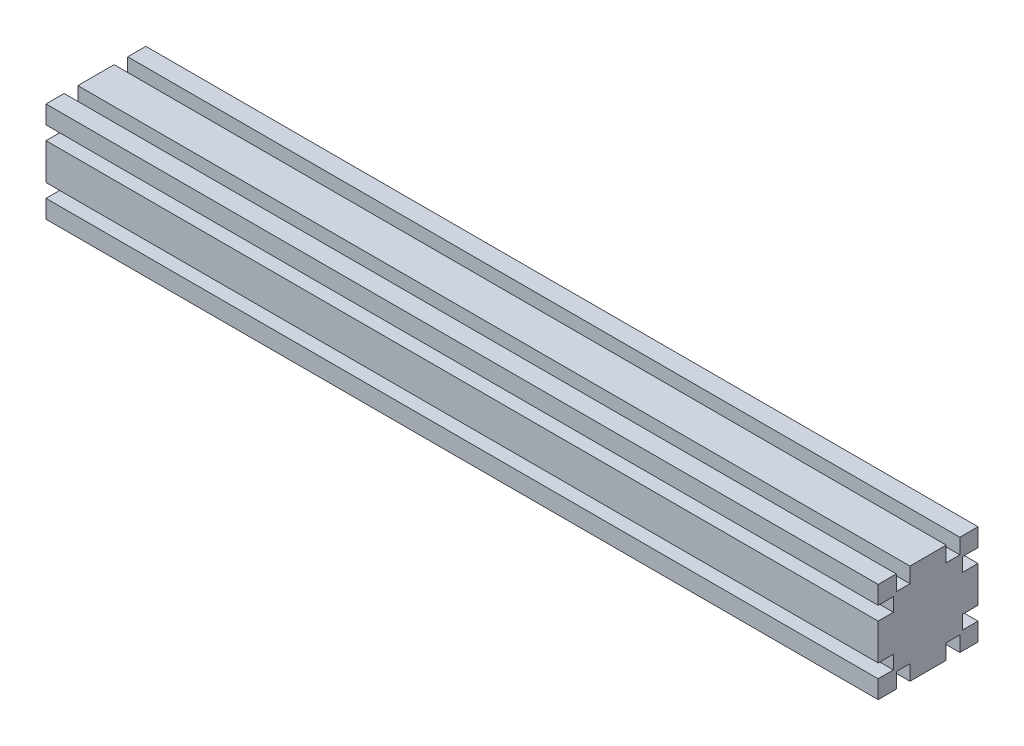
ISO-10303-21;
HEADER;
FILE_DESCRIPTION(('STEP AP214'),'2;1');
FILE_NAME('part.step','',(''),(''),'','','');
FILE_SCHEMA(('AUTOMOTIVE_DESIGN { 1 0 10303 214 1 1 1 1 }'));
ENDSEC;
DATA;
#1=APPLICATION_CONTEXT('core data for automotive mechanical design processes');
#2=APPLICATION_PROTOCOL_DEFINITION('international standard','automotive_design',2000,#1);
#3=PRODUCT_CONTEXT('',#1,'mechanical');
#4=PRODUCT('Part','Part','',(#3));
#5=PRODUCT_RELATED_PRODUCT_CATEGORY('part','',(#4));
#6=PRODUCT_DEFINITION_FORMATION('','',#4);
#7=PRODUCT_DEFINITION_CONTEXT('part definition',#1,'design');
#8=PRODUCT_DEFINITION('design','',#6,#7);
#9=PRODUCT_DEFINITION_SHAPE('','',#8);
#10=(LENGTH_UNIT() NAMED_UNIT(*) SI_UNIT(.MILLI.,.METRE.));
#11=(NAMED_UNIT(*) PLANE_ANGLE_UNIT() SI_UNIT($,.RADIAN.));
#12=(NAMED_UNIT(*) SI_UNIT($,.STERADIAN.) SOLID_ANGLE_UNIT());
#13=UNCERTAINTY_MEASURE_WITH_UNIT(LENGTH_MEASURE(1.E-05),#10,'distance_accuracy_value','');
#14=(GEOMETRIC_REPRESENTATION_CONTEXT(3) GLOBAL_UNCERTAINTY_ASSIGNED_CONTEXT((#13)) GLOBAL_UNIT_ASSIGNED_CONTEXT((#10,
#11,#12)) REPRESENTATION_CONTEXT('',''));
#15=CARTESIAN_POINT('',(0.,0.,0.));
#16=DIRECTION('',(0.,0.,1.));
#17=DIRECTION('',(1.,0.,0.));
#18=AXIS2_PLACEMENT_3D('',#15,#16,#17);
#19=CARTESIAN_POINT('',(500.,30.,-30.));
#20=DIRECTION('',(0.,0.,1.));
#21=DIRECTION('',(0.,-1.,0.));
#22=AXIS2_PLACEMENT_3D('',#19,#20,#21);
#23=PLANE('',#22);
#24=DIRECTION('',(0.,1.,0.));
#25=VECTOR('',#24,1.);
#26=CARTESIAN_POINT('',(500.,30.,-30.));
#27=LINE('',#26,#25);
#28=CARTESIAN_POINT('',(500.,19.1,-30.));
#29=VERTEX_POINT('',#28);
#30=CARTESIAN_POINT('',(500.,30.,-30.));
#31=VERTEX_POINT('',#30);
#32=EDGE_CURVE('E299',#29,#31,#27,.T.);
#33=ORIENTED_EDGE('',*,*,#32,.F.);
#34=DIRECTION('',(-1.,0.,0.));
#35=VECTOR('',#34,1.);
#36=CARTESIAN_POINT('',(500.,19.1,-30.));
#37=LINE('',#36,#35);
#38=CARTESIAN_POINT('',(0.,19.1,-30.));
#39=VERTEX_POINT('',#38);
#40=EDGE_CURVE('E451',#29,#39,#37,.T.);
#41=ORIENTED_EDGE('',*,*,#40,.T.);
#42=DIRECTION('',(0.,1.,0.));
#43=VECTOR('',#42,1.);
#44=CARTESIAN_POINT('',(0.,30.,-30.));
#45=LINE('',#44,#43);
#46=CARTESIAN_POINT('',(0.,30.,-30.));
#47=VERTEX_POINT('',#46);
#48=EDGE_CURVE('E328',#39,#47,#45,.T.);
#49=ORIENTED_EDGE('',*,*,#48,.T.);
#50=DIRECTION('',(-1.,0.,0.));
#51=VECTOR('',#50,1.);
#52=CARTESIAN_POINT('',(500.,30.,-30.));
#53=LINE('',#52,#51);
#54=EDGE_CURVE('E11',#31,#47,#53,.T.);
#55=ORIENTED_EDGE('',*,*,#54,.F.);
#56=EDGE_LOOP('',(#33,#41,#49,#55));
#57=FACE_BOUND('',#56,.T.);
#58=ADVANCED_FACE('F36',(#57),#23,.F.);
#59=CARTESIAN_POINT('',(0.,-10.9,-30.));
#60=VERTEX_POINT('',#59);
#61=CARTESIAN_POINT('',(0.,10.9,-30.));
#62=VERTEX_POINT('',#61);
#63=EDGE_CURVE('E327',#60,#62,#45,.T.);
#64=ORIENTED_EDGE('',*,*,#63,.T.);
#65=DIRECTION('',(-1.,0.,0.));
#66=VECTOR('',#65,1.);
#67=CARTESIAN_POINT('',(500.,10.9,-30.));
#68=LINE('',#67,#66);
#69=CARTESIAN_POINT('',(500.,10.9,-30.));
#70=VERTEX_POINT('',#69);
#71=EDGE_CURVE('E297',#70,#62,#68,.T.);
#72=ORIENTED_EDGE('',*,*,#71,.F.);
#73=CARTESIAN_POINT('',(500.,-10.9,-30.));
#74=VERTEX_POINT('',#73);
#75=EDGE_CURVE('E289',#74,#70,#27,.T.);
#76=ORIENTED_EDGE('',*,*,#75,.F.);
#77=DIRECTION('',(-1.,0.,0.));
#78=VECTOR('',#77,1.);
#79=CARTESIAN_POINT('',(500.,-10.9,-30.));
#80=LINE('',#79,#78);
#81=EDGE_CURVE('E270',#74,#60,#80,.T.);
#82=ORIENTED_EDGE('',*,*,#81,.T.);
#83=EDGE_LOOP('',(#64,#72,#76,#82));
#84=FACE_BOUND('',#83,.T.);
#85=ADVANCED_FACE('F296',(#84),#23,.F.);
#86=CARTESIAN_POINT('',(500.,30.,30.));
#87=DIRECTION('',(0.,-1.,0.));
#88=DIRECTION('',(0.,0.,-1.));
#89=AXIS2_PLACEMENT_3D('',#86,#87,#88);
#90=PLANE('',#89);
#91=DIRECTION('',(0.,0.,1.));
#92=VECTOR('',#91,1.);
#93=CARTESIAN_POINT('',(500.,30.,30.));
#94=LINE('',#93,#92);
#95=CARTESIAN_POINT('',(500.,30.,19.1));
#96=VERTEX_POINT('',#95);
#97=CARTESIAN_POINT('',(500.,30.,30.));
#98=VERTEX_POINT('',#97);
#99=EDGE_CURVE('E302',#96,#98,#94,.T.);
#100=ORIENTED_EDGE('',*,*,#99,.F.);
#101=DIRECTION('',(-1.,0.,0.));
#102=VECTOR('',#101,1.);
#103=CARTESIAN_POINT('',(500.,30.,19.1));
#104=LINE('',#103,#102);
#105=CARTESIAN_POINT('',(0.,30.,19.1));
#106=VERTEX_POINT('',#105);
#107=EDGE_CURVE('E447',#96,#106,#104,.T.);
#108=ORIENTED_EDGE('',*,*,#107,.T.);
#109=DIRECTION('',(0.,0.,1.));
#110=VECTOR('',#109,1.);
#111=CARTESIAN_POINT('',(0.,30.,30.));
#112=LINE('',#111,#110);
#113=CARTESIAN_POINT('',(0.,30.,30.));
#114=VERTEX_POINT('',#113);
#115=EDGE_CURVE('E326',#106,#114,#112,.T.);
#116=ORIENTED_EDGE('',*,*,#115,.T.);
#117=DIRECTION('',(-1.,0.,0.));
#118=VECTOR('',#117,1.);
#119=CARTESIAN_POINT('',(500.,30.,30.));
#120=LINE('',#119,#118);
#121=EDGE_CURVE('E44',#98,#114,#120,.T.);
#122=ORIENTED_EDGE('',*,*,#121,.F.);
#123=EDGE_LOOP('',(#100,#108,#116,#122));
#124=FACE_BOUND('',#123,.T.);
#125=ADVANCED_FACE('F550',(#124),#90,.F.);
#126=CARTESIAN_POINT('',(0.,30.,-10.9));
#127=VERTEX_POINT('',#126);
#128=CARTESIAN_POINT('',(0.,30.,10.9));
#129=VERTEX_POINT('',#128);
#130=EDGE_CURVE('E333',#127,#129,#112,.T.);
#131=ORIENTED_EDGE('',*,*,#130,.T.);
#132=DIRECTION('',(-1.,0.,0.));
#133=VECTOR('',#132,1.);
#134=CARTESIAN_POINT('',(500.,30.,10.9));
#135=LINE('',#134,#133);
#136=CARTESIAN_POINT('',(500.,30.,10.9));
#137=VERTEX_POINT('',#136);
#138=EDGE_CURVE('E59',#137,#129,#135,.T.);
#139=ORIENTED_EDGE('',*,*,#138,.F.);
#140=CARTESIAN_POINT('',(500.,30.,-10.9));
#141=VERTEX_POINT('',#140);
#142=EDGE_CURVE('E312',#141,#137,#94,.T.);
#143=ORIENTED_EDGE('',*,*,#142,.F.);
#144=DIRECTION('',(-1.,0.,0.));
#145=VECTOR('',#144,1.);
#146=CARTESIAN_POINT('',(500.,30.,-10.9));
#147=LINE('',#146,#145);
#148=EDGE_CURVE('E501',#141,#127,#147,.T.);
#149=ORIENTED_EDGE('',*,*,#148,.T.);
#150=EDGE_LOOP('',(#131,#139,#143,#149));
#151=FACE_BOUND('',#150,.T.);
#152=ADVANCED_FACE('F558',(#151),#90,.F.);
#153=CARTESIAN_POINT('',(500.,30.,30.));
#154=DIRECTION('',(0.,0.,-1.));
#155=DIRECTION('',(0.,1.,0.));
#156=AXIS2_PLACEMENT_3D('',#153,#154,#155);
#157=PLANE('',#156);
#158=DIRECTION('',(0.,-1.,0.));
#159=VECTOR('',#158,1.);
#160=CARTESIAN_POINT('',(500.,30.,30.));
#161=LINE('',#160,#159);
#162=CARTESIAN_POINT('',(500.,-19.1,30.));
#163=VERTEX_POINT('',#162);
#164=CARTESIAN_POINT('',(500.,-30.,30.));
#165=VERTEX_POINT('',#164);
#166=EDGE_CURVE('E311',#163,#165,#161,.T.);
#167=ORIENTED_EDGE('',*,*,#166,.F.);
#168=DIRECTION('',(-1.,0.,0.));
#169=VECTOR('',#168,1.);
#170=CARTESIAN_POINT('',(500.,-19.1,30.));
#171=LINE('',#170,#169);
#172=CARTESIAN_POINT('',(0.,-19.1,30.));
#173=VERTEX_POINT('',#172);
#174=EDGE_CURVE('E574',#163,#173,#171,.T.);
#175=ORIENTED_EDGE('',*,*,#174,.T.);
#176=DIRECTION('',(0.,-1.,0.));
#177=VECTOR('',#176,1.);
#178=CARTESIAN_POINT('',(0.,30.,30.));
#179=LINE('',#178,#177);
#180=CARTESIAN_POINT('',(0.,-30.,30.));
#181=VERTEX_POINT('',#180);
#182=EDGE_CURVE('E332',#173,#181,#179,.T.);
#183=ORIENTED_EDGE('',*,*,#182,.T.);
#184=DIRECTION('',(-1.,0.,0.));
#185=VECTOR('',#184,1.);
#186=CARTESIAN_POINT('',(500.,-30.,30.));
#187=LINE('',#186,#185);
#188=EDGE_CURVE('E344',#165,#181,#187,.T.);
#189=ORIENTED_EDGE('',*,*,#188,.F.);
#190=EDGE_LOOP('',(#167,#175,#183,#189));
#191=FACE_BOUND('',#190,.T.);
#192=ADVANCED_FACE('F630',(#191),#157,.F.);
#193=CARTESIAN_POINT('',(0.,10.9,30.));
#194=VERTEX_POINT('',#193);
#195=CARTESIAN_POINT('',(0.,-10.9,30.));
#196=VERTEX_POINT('',#195);
#197=EDGE_CURVE('E338',#194,#196,#179,.T.);
#198=ORIENTED_EDGE('',*,*,#197,.T.);
#199=DIRECTION('',(-1.,0.,0.));
#200=VECTOR('',#199,1.);
#201=CARTESIAN_POINT('',(500.,-10.9,30.));
#202=LINE('',#201,#200);
#203=CARTESIAN_POINT('',(500.,-10.9,30.));
#204=VERTEX_POINT('',#203);
#205=EDGE_CURVE('E592',#204,#196,#202,.T.);
#206=ORIENTED_EDGE('',*,*,#205,.F.);
#207=CARTESIAN_POINT('',(500.,10.9,30.));
#208=VERTEX_POINT('',#207);
#209=EDGE_CURVE('E317',#208,#204,#161,.T.);
#210=ORIENTED_EDGE('',*,*,#209,.F.);
#211=DIRECTION('',(-1.,0.,0.));
#212=VECTOR('',#211,1.);
#213=CARTESIAN_POINT('',(500.,10.9,30.));
#214=LINE('',#213,#212);
#215=EDGE_CURVE('E382',#208,#194,#214,.T.);
#216=ORIENTED_EDGE('',*,*,#215,.T.);
#217=EDGE_LOOP('',(#198,#206,#210,#216));
#218=FACE_BOUND('',#217,.T.);
#219=ADVANCED_FACE('F622',(#218),#157,.F.);
#220=CARTESIAN_POINT('',(500.,-30.,30.));
#221=DIRECTION('',(0.,1.,0.));
#222=DIRECTION('',(0.,0.,1.));
#223=AXIS2_PLACEMENT_3D('',#220,#221,#222);
#224=PLANE('',#223);
#225=DIRECTION('',(0.,0.,-1.));
#226=VECTOR('',#225,1.);
#227=CARTESIAN_POINT('',(500.,-30.,30.));
#228=LINE('',#227,#226);
#229=CARTESIAN_POINT('',(500.,-30.,-19.1));
#230=VERTEX_POINT('',#229);
#231=CARTESIAN_POINT('',(500.,-30.,-30.));
#232=VERTEX_POINT('',#231);
#233=EDGE_CURVE('E316',#230,#232,#228,.T.);
#234=ORIENTED_EDGE('',*,*,#233,.F.);
#235=DIRECTION('',(-1.,0.,0.));
#236=VECTOR('',#235,1.);
#237=CARTESIAN_POINT('',(500.,-30.,-19.1));
#238=LINE('',#237,#236);
#239=CARTESIAN_POINT('',(0.,-30.,-19.1));
#240=VERTEX_POINT('',#239);
#241=EDGE_CURVE('E395',#230,#240,#238,.T.);
#242=ORIENTED_EDGE('',*,*,#241,.T.);
#243=DIRECTION('',(0.,0.,-1.));
#244=VECTOR('',#243,1.);
#245=CARTESIAN_POINT('',(0.,-30.,30.));
#246=LINE('',#245,#244);
#247=CARTESIAN_POINT('',(0.,-30.,-30.));
#248=VERTEX_POINT('',#247);
#249=EDGE_CURVE('E337',#240,#248,#246,.T.);
#250=ORIENTED_EDGE('',*,*,#249,.T.);
#251=DIRECTION('',(-1.,0.,0.));
#252=VECTOR('',#251,1.);
#253=CARTESIAN_POINT('',(500.,-30.,-30.));
#254=LINE('',#253,#252);
#255=EDGE_CURVE('E321',#232,#248,#254,.T.);
#256=ORIENTED_EDGE('',*,*,#255,.F.);
#257=EDGE_LOOP('',(#234,#242,#250,#256));
#258=FACE_BOUND('',#257,.T.);
#259=ADVANCED_FACE('F559',(#258),#224,.F.);
#260=CARTESIAN_POINT('',(0.,-30.,19.1));
#261=VERTEX_POINT('',#260);
#262=EDGE_CURVE('E303',#181,#261,#246,.T.);
#263=ORIENTED_EDGE('',*,*,#262,.T.);
#264=DIRECTION('',(-1.,0.,0.));
#265=VECTOR('',#264,1.);
#266=CARTESIAN_POINT('',(500.,-30.,19.1));
#267=LINE('',#266,#265);
#268=CARTESIAN_POINT('',(500.,-30.,19.1));
#269=VERTEX_POINT('',#268);
#270=EDGE_CURVE('E399',#269,#261,#267,.T.);
#271=ORIENTED_EDGE('',*,*,#270,.F.);
#272=EDGE_CURVE('E318',#165,#269,#228,.T.);
#273=ORIENTED_EDGE('',*,*,#272,.F.);
#274=ORIENTED_EDGE('',*,*,#188,.T.);
#275=EDGE_LOOP('',(#263,#271,#273,#274));
#276=FACE_BOUND('',#275,.T.);
#277=ADVANCED_FACE('F552',(#276),#224,.F.);
#278=CARTESIAN_POINT('',(0.,-19.1,-30.));
#279=VERTEX_POINT('',#278);
#280=EDGE_CURVE('E323',#248,#279,#45,.T.);
#281=ORIENTED_EDGE('',*,*,#280,.T.);
#282=DIRECTION('',(-1.,0.,0.));
#283=VECTOR('',#282,1.);
#284=CARTESIAN_POINT('',(500.,-19.1,-30.));
#285=LINE('',#284,#283);
#286=CARTESIAN_POINT('',(500.,-19.1,-30.));
#287=VERTEX_POINT('',#286);
#288=EDGE_CURVE('E281',#287,#279,#285,.T.);
#289=ORIENTED_EDGE('',*,*,#288,.F.);
#290=EDGE_CURVE('E298',#232,#287,#27,.T.);
#291=ORIENTED_EDGE('',*,*,#290,.F.);
#292=ORIENTED_EDGE('',*,*,#255,.T.);
#293=EDGE_LOOP('',(#281,#289,#291,#292));
#294=FACE_BOUND('',#293,.T.);
#295=ADVANCED_FACE('F38',(#294),#23,.F.);
#296=CARTESIAN_POINT('',(0.,30.,-19.1));
#297=VERTEX_POINT('',#296);
#298=EDGE_CURVE('E329',#47,#297,#112,.T.);
#299=ORIENTED_EDGE('',*,*,#298,.T.);
#300=DIRECTION('',(-1.,0.,0.));
#301=VECTOR('',#300,1.);
#302=CARTESIAN_POINT('',(500.,30.,-19.1));
#303=LINE('',#302,#301);
#304=CARTESIAN_POINT('',(500.,30.,-19.1));
#305=VERTEX_POINT('',#304);
#306=EDGE_CURVE('E306',#305,#297,#303,.T.);
#307=ORIENTED_EDGE('',*,*,#306,.F.);
#308=EDGE_CURVE('E308',#31,#305,#94,.T.);
#309=ORIENTED_EDGE('',*,*,#308,.F.);
#310=ORIENTED_EDGE('',*,*,#54,.T.);
#311=EDGE_LOOP('',(#299,#307,#309,#310));
#312=FACE_BOUND('',#311,.T.);
#313=ADVANCED_FACE('F518',(#312),#90,.F.);
#314=CARTESIAN_POINT('',(0.,19.1,30.));
#315=VERTEX_POINT('',#314);
#316=EDGE_CURVE('E334',#114,#315,#179,.T.);
#317=ORIENTED_EDGE('',*,*,#316,.T.);
#318=DIRECTION('',(-1.,0.,0.));
#319=VECTOR('',#318,1.);
#320=CARTESIAN_POINT('',(500.,19.1,30.));
#321=LINE('',#320,#319);
#322=CARTESIAN_POINT('',(500.,19.1,30.));
#323=VERTEX_POINT('',#322);
#324=EDGE_CURVE('E380',#323,#315,#321,.T.);
#325=ORIENTED_EDGE('',*,*,#324,.F.);
#326=EDGE_CURVE('E313',#98,#323,#161,.T.);
#327=ORIENTED_EDGE('',*,*,#326,.F.);
#328=ORIENTED_EDGE('',*,*,#121,.T.);
#329=EDGE_LOOP('',(#317,#325,#327,#328));
#330=FACE_BOUND('',#329,.T.);
#331=ADVANCED_FACE('F351',(#330),#157,.F.);
#332=CARTESIAN_POINT('',(0.,-30.,10.9));
#333=VERTEX_POINT('',#332);
#334=CARTESIAN_POINT('',(0.,-30.,-10.9));
#335=VERTEX_POINT('',#334);
#336=EDGE_CURVE('E341',#333,#335,#246,.T.);
#337=ORIENTED_EDGE('',*,*,#336,.T.);
#338=DIRECTION('',(-1.,0.,0.));
#339=VECTOR('',#338,1.);
#340=CARTESIAN_POINT('',(500.,-30.,-10.9));
#341=LINE('',#340,#339);
#342=CARTESIAN_POINT('',(500.,-30.,-10.9));
#343=VERTEX_POINT('',#342);
#344=EDGE_CURVE('E409',#343,#335,#341,.T.);
#345=ORIENTED_EDGE('',*,*,#344,.F.);
#346=CARTESIAN_POINT('',(500.,-30.,10.9));
#347=VERTEX_POINT('',#346);
#348=EDGE_CURVE('E322',#347,#343,#228,.T.);
#349=ORIENTED_EDGE('',*,*,#348,.F.);
#350=DIRECTION('',(-1.,0.,0.));
#351=VECTOR('',#350,1.);
#352=CARTESIAN_POINT('',(500.,-30.,10.9));
#353=LINE('',#352,#351);
#354=EDGE_CURVE('E431',#347,#333,#353,.T.);
#355=ORIENTED_EDGE('',*,*,#354,.T.);
#356=EDGE_LOOP('',(#337,#345,#349,#355));
#357=FACE_BOUND('',#356,.T.);
#358=ADVANCED_FACE('F562',(#357),#224,.F.);
#359=CARTESIAN_POINT('',(500.,0.,0.));
#360=DIRECTION('',(1.,0.,0.));
#361=DIRECTION('',(0.,0.,-1.));
#362=AXIS2_PLACEMENT_3D('',#359,#360,#361);
#363=PLANE('',#362);
#364=DIRECTION('',(0.,-1.,0.));
#365=VECTOR('',#364,1.);
#366=CARTESIAN_POINT('',(500.,-30.,-19.1));
#367=LINE('',#366,#365);
#368=CARTESIAN_POINT('',(500.,-20.8,-19.1));
#369=VERTEX_POINT('',#368);
#370=EDGE_CURVE('E386',#369,#230,#367,.T.);
#371=ORIENTED_EDGE('',*,*,#370,.T.);
#372=ORIENTED_EDGE('',*,*,#233,.T.);
#373=ORIENTED_EDGE('',*,*,#290,.T.);
#374=DIRECTION('',(0.,0.,1.));
#375=VECTOR('',#374,1.);
#376=CARTESIAN_POINT('',(500.,-19.1,-30.));
#377=LINE('',#376,#375);
#378=CARTESIAN_POINT('',(500.,-19.1,-20.8));
#379=VERTEX_POINT('',#378);
#380=EDGE_CURVE('E292',#287,#379,#377,.T.);
#381=ORIENTED_EDGE('',*,*,#380,.T.);
#382=DIRECTION('',(0.,1.,0.));
#383=VECTOR('',#382,1.);
#384=CARTESIAN_POINT('',(500.,-19.1,-20.8));
#385=LINE('',#384,#383);
#386=CARTESIAN_POINT('',(500.,-10.9,-20.8));
#387=VERTEX_POINT('',#386);
#388=EDGE_CURVE('E282',#379,#387,#385,.T.);
#389=ORIENTED_EDGE('',*,*,#388,.T.);
#390=DIRECTION('',(0.,0.,-1.));
#391=VECTOR('',#390,1.);
#392=CARTESIAN_POINT('',(500.,-10.9,-20.8));
#393=LINE('',#392,#391);
#394=EDGE_CURVE('E273',#387,#74,#393,.T.);
#395=ORIENTED_EDGE('',*,*,#394,.T.);
#396=ORIENTED_EDGE('',*,*,#75,.T.);
#397=DIRECTION('',(0.,0.,1.));
#398=VECTOR('',#397,1.);
#399=CARTESIAN_POINT('',(500.,10.9,-20.8));
#400=LINE('',#399,#398);
#401=CARTESIAN_POINT('',(500.,10.9,-20.8));
#402=VERTEX_POINT('',#401);
#403=EDGE_CURVE('E461',#70,#402,#400,.T.);
#404=ORIENTED_EDGE('',*,*,#403,.T.);
#405=DIRECTION('',(0.,1.,0.));
#406=VECTOR('',#405,1.);
#407=CARTESIAN_POINT('',(500.,19.1,-20.8));
#408=LINE('',#407,#406);
#409=CARTESIAN_POINT('',(500.,19.1,-20.8));
#410=VERTEX_POINT('',#409);
#411=EDGE_CURVE('E463',#402,#410,#408,.T.);
#412=ORIENTED_EDGE('',*,*,#411,.T.);
#413=DIRECTION('',(0.,0.,-1.));
#414=VECTOR('',#413,1.);
#415=CARTESIAN_POINT('',(500.,19.1,-30.));
#416=LINE('',#415,#414);
#417=EDGE_CURVE('E467',#410,#29,#416,.T.);
#418=ORIENTED_EDGE('',*,*,#417,.T.);
#419=ORIENTED_EDGE('',*,*,#32,.T.);
#420=ORIENTED_EDGE('',*,*,#308,.T.);
#421=DIRECTION('',(0.,-1.,0.));
#422=VECTOR('',#421,1.);
#423=CARTESIAN_POINT('',(500.,30.,-19.1));
#424=LINE('',#423,#422);
#425=CARTESIAN_POINT('',(500.,20.8,-19.1));
#426=VERTEX_POINT('',#425);
#427=EDGE_CURVE('E485',#305,#426,#424,.T.);
#428=ORIENTED_EDGE('',*,*,#427,.T.);
#429=DIRECTION('',(0.,0.,1.));
#430=VECTOR('',#429,1.);
#431=CARTESIAN_POINT('',(500.,20.8,-19.1));
#432=LINE('',#431,#430);
#433=CARTESIAN_POINT('',(500.,20.8,-10.9));
#434=VERTEX_POINT('',#433);
#435=EDGE_CURVE('E488',#426,#434,#432,.T.);
#436=ORIENTED_EDGE('',*,*,#435,.T.);
#437=DIRECTION('',(0.,1.,0.));
#438=VECTOR('',#437,1.);
#439=CARTESIAN_POINT('',(500.,20.8,-10.9));
#440=LINE('',#439,#438);
#441=EDGE_CURVE('E492',#434,#141,#440,.T.);
#442=ORIENTED_EDGE('',*,*,#441,.T.);
#443=ORIENTED_EDGE('',*,*,#142,.T.);
#444=DIRECTION('',(0.,-1.,0.));
#445=VECTOR('',#444,1.);
#446=CARTESIAN_POINT('',(500.,20.8,10.9));
#447=LINE('',#446,#445);
#448=CARTESIAN_POINT('',(500.,20.8,10.9));
#449=VERTEX_POINT('',#448);
#450=EDGE_CURVE('E440',#137,#449,#447,.T.);
#451=ORIENTED_EDGE('',*,*,#450,.T.);
#452=DIRECTION('',(0.,0.,1.));
#453=VECTOR('',#452,1.);
#454=CARTESIAN_POINT('',(500.,20.8,19.1));
#455=LINE('',#454,#453);
#456=CARTESIAN_POINT('',(500.,20.8,19.1));
#457=VERTEX_POINT('',#456);
#458=EDGE_CURVE('E444',#449,#457,#455,.T.);
#459=ORIENTED_EDGE('',*,*,#458,.T.);
#460=DIRECTION('',(0.,1.,0.));
#461=VECTOR('',#460,1.);
#462=CARTESIAN_POINT('',(500.,30.,19.1));
#463=LINE('',#462,#461);
#464=EDGE_CURVE('E437',#457,#96,#463,.T.);
#465=ORIENTED_EDGE('',*,*,#464,.T.);
#466=ORIENTED_EDGE('',*,*,#99,.T.);
#467=ORIENTED_EDGE('',*,*,#326,.T.);
#468=DIRECTION('',(0.,0.,-1.));
#469=VECTOR('',#468,1.);
#470=CARTESIAN_POINT('',(500.,19.1,30.));
#471=LINE('',#470,#469);
#472=CARTESIAN_POINT('',(500.,19.1,20.8));
#473=VERTEX_POINT('',#472);
#474=EDGE_CURVE('E608',#323,#473,#471,.T.);
#475=ORIENTED_EDGE('',*,*,#474,.T.);
#476=DIRECTION('',(0.,-1.,0.));
#477=VECTOR('',#476,1.);
#478=CARTESIAN_POINT('',(500.,19.1,20.8));
#479=LINE('',#478,#477);
#480=CARTESIAN_POINT('',(500.,10.9,20.8));
#481=VERTEX_POINT('',#480);
#482=EDGE_CURVE('E385',#473,#481,#479,.T.);
#483=ORIENTED_EDGE('',*,*,#482,.T.);
#484=DIRECTION('',(0.,0.,1.));
#485=VECTOR('',#484,1.);
#486=CARTESIAN_POINT('',(500.,10.9,20.8));
#487=LINE('',#486,#485);
#488=EDGE_CURVE('E370',#481,#208,#487,.T.);
#489=ORIENTED_EDGE('',*,*,#488,.T.);
#490=ORIENTED_EDGE('',*,*,#209,.T.);
#491=DIRECTION('',(0.,0.,-1.));
#492=VECTOR('',#491,1.);
#493=CARTESIAN_POINT('',(500.,-10.9,20.8));
#494=LINE('',#493,#492);
#495=CARTESIAN_POINT('',(500.,-10.9,20.8));
#496=VERTEX_POINT('',#495);
#497=EDGE_CURVE('E582',#204,#496,#494,.T.);
#498=ORIENTED_EDGE('',*,*,#497,.T.);
#499=DIRECTION('',(0.,-1.,0.));
#500=VECTOR('',#499,1.);
#501=CARTESIAN_POINT('',(500.,-19.1,20.8));
#502=LINE('',#501,#500);
#503=CARTESIAN_POINT('',(500.,-19.1,20.8));
#504=VERTEX_POINT('',#503);
#505=EDGE_CURVE('E585',#496,#504,#502,.T.);
#506=ORIENTED_EDGE('',*,*,#505,.T.);
#507=DIRECTION('',(0.,0.,1.));
#508=VECTOR('',#507,1.);
#509=CARTESIAN_POINT('',(500.,-19.1,30.));
#510=LINE('',#509,#508);
#511=EDGE_CURVE('E589',#504,#163,#510,.T.);
#512=ORIENTED_EDGE('',*,*,#511,.T.);
#513=ORIENTED_EDGE('',*,*,#166,.T.);
#514=ORIENTED_EDGE('',*,*,#272,.T.);
#515=DIRECTION('',(0.,1.,0.));
#516=VECTOR('',#515,1.);
#517=CARTESIAN_POINT('',(500.,-30.,19.1));
#518=LINE('',#517,#516);
#519=CARTESIAN_POINT('',(500.,-20.8,19.1));
#520=VERTEX_POINT('',#519);
#521=EDGE_CURVE('E413',#269,#520,#518,.T.);
#522=ORIENTED_EDGE('',*,*,#521,.T.);
#523=DIRECTION('',(0.,0.,-1.));
#524=VECTOR('',#523,1.);
#525=CARTESIAN_POINT('',(500.,-20.8,19.1));
#526=LINE('',#525,#524);
#527=CARTESIAN_POINT('',(500.,-20.8,10.9));
#528=VERTEX_POINT('',#527);
#529=EDGE_CURVE('E416',#520,#528,#526,.T.);
#530=ORIENTED_EDGE('',*,*,#529,.T.);
#531=DIRECTION('',(0.,-1.,0.));
#532=VECTOR('',#531,1.);
#533=CARTESIAN_POINT('',(500.,-20.8,10.9));
#534=LINE('',#533,#532);
#535=EDGE_CURVE('E420',#528,#347,#534,.T.);
#536=ORIENTED_EDGE('',*,*,#535,.T.);
#537=ORIENTED_EDGE('',*,*,#348,.T.);
#538=DIRECTION('',(0.,1.,0.));
#539=VECTOR('',#538,1.);
#540=CARTESIAN_POINT('',(500.,-20.8,-10.9));
#541=LINE('',#540,#539);
#542=CARTESIAN_POINT('',(500.,-20.8,-10.9));
#543=VERTEX_POINT('',#542);
#544=EDGE_CURVE('E388',#343,#543,#541,.T.);
#545=ORIENTED_EDGE('',*,*,#544,.T.);
#546=DIRECTION('',(0.,0.,-1.));
#547=VECTOR('',#546,1.);
#548=CARTESIAN_POINT('',(500.,-20.8,-19.1));
#549=LINE('',#548,#547);
#550=EDGE_CURVE('E392',#543,#369,#549,.T.);
#551=ORIENTED_EDGE('',*,*,#550,.T.);
#552=EDGE_LOOP('',(#371,#372,#373,#381,#389,#395,#396,#404,#412,#418,#419,#420,#428,#436,#442,
#443,#451,#459,#465,#466,#467,#475,#483,#489,#490,#498,#506,#512,#513,#514,#522,#530,#536,#537,
#545,#551));
#553=FACE_BOUND('',#552,.T.);
#554=ADVANCED_FACE('F287',(#553),#363,.T.);
#555=CARTESIAN_POINT('',(0.,0.,0.));
#556=DIRECTION('',(1.,0.,0.));
#557=DIRECTION('',(0.,0.,-1.));
#558=AXIS2_PLACEMENT_3D('',#555,#556,#557);
#559=PLANE('',#558);
#560=ORIENTED_EDGE('',*,*,#249,.F.);
#561=DIRECTION('',(0.,-1.,0.));
#562=VECTOR('',#561,1.);
#563=CARTESIAN_POINT('',(0.,-30.,-19.1));
#564=LINE('',#563,#562);
#565=CARTESIAN_POINT('',(0.,-20.8,-19.1));
#566=VERTEX_POINT('',#565);
#567=EDGE_CURVE('E396',#566,#240,#564,.T.);
#568=ORIENTED_EDGE('',*,*,#567,.F.);
#569=DIRECTION('',(0.,0.,-1.));
#570=VECTOR('',#569,1.);
#571=CARTESIAN_POINT('',(0.,-20.8,-19.1));
#572=LINE('',#571,#570);
#573=CARTESIAN_POINT('',(0.,-20.8,-10.9));
#574=VERTEX_POINT('',#573);
#575=EDGE_CURVE('E389',#574,#566,#572,.T.);
#576=ORIENTED_EDGE('',*,*,#575,.F.);
#577=DIRECTION('',(0.,1.,0.));
#578=VECTOR('',#577,1.);
#579=CARTESIAN_POINT('',(0.,-20.8,-10.9));
#580=LINE('',#579,#578);
#581=EDGE_CURVE('E398',#335,#574,#580,.T.);
#582=ORIENTED_EDGE('',*,*,#581,.F.);
#583=ORIENTED_EDGE('',*,*,#336,.F.);
#584=DIRECTION('',(0.,-1.,0.));
#585=VECTOR('',#584,1.);
#586=CARTESIAN_POINT('',(0.,-20.8,10.9));
#587=LINE('',#586,#585);
#588=CARTESIAN_POINT('',(0.,-20.8,10.9));
#589=VERTEX_POINT('',#588);
#590=EDGE_CURVE('E417',#589,#333,#587,.T.);
#591=ORIENTED_EDGE('',*,*,#590,.F.);
#592=DIRECTION('',(0.,0.,-1.));
#593=VECTOR('',#592,1.);
#594=CARTESIAN_POINT('',(0.,-20.8,19.1));
#595=LINE('',#594,#593);
#596=CARTESIAN_POINT('',(0.,-20.8,19.1));
#597=VERTEX_POINT('',#596);
#598=EDGE_CURVE('E425',#597,#589,#595,.T.);
#599=ORIENTED_EDGE('',*,*,#598,.F.);
#600=DIRECTION('',(0.,1.,0.));
#601=VECTOR('',#600,1.);
#602=CARTESIAN_POINT('',(0.,-30.,19.1));
#603=LINE('',#602,#601);
#604=EDGE_CURVE('E51',#261,#597,#603,.T.);
#605=ORIENTED_EDGE('',*,*,#604,.F.);
#606=ORIENTED_EDGE('',*,*,#262,.F.);
#607=ORIENTED_EDGE('',*,*,#182,.F.);
#608=DIRECTION('',(0.,0.,1.));
#609=VECTOR('',#608,1.);
#610=CARTESIAN_POINT('',(0.,-19.1,30.));
#611=LINE('',#610,#609);
#612=CARTESIAN_POINT('',(0.,-19.1,20.8));
#613=VERTEX_POINT('',#612);
#614=EDGE_CURVE('E586',#613,#173,#611,.T.);
#615=ORIENTED_EDGE('',*,*,#614,.F.);
#616=DIRECTION('',(0.,-1.,0.));
#617=VECTOR('',#616,1.);
#618=CARTESIAN_POINT('',(0.,-19.1,20.8));
#619=LINE('',#618,#617);
#620=CARTESIAN_POINT('',(0.,-10.9,20.8));
#621=VERTEX_POINT('',#620);
#622=EDGE_CURVE('E595',#621,#613,#619,.T.);
#623=ORIENTED_EDGE('',*,*,#622,.F.);
#624=DIRECTION('',(0.,0.,-1.));
#625=VECTOR('',#624,1.);
#626=CARTESIAN_POINT('',(0.,-10.9,20.8));
#627=LINE('',#626,#625);
#628=EDGE_CURVE('E377',#196,#621,#627,.T.);
#629=ORIENTED_EDGE('',*,*,#628,.F.);
#630=ORIENTED_EDGE('',*,*,#197,.F.);
#631=DIRECTION('',(0.,0.,1.));
#632=VECTOR('',#631,1.);
#633=CARTESIAN_POINT('',(0.,10.9,20.8));
#634=LINE('',#633,#632);
#635=CARTESIAN_POINT('',(0.,10.9,20.8));
#636=VERTEX_POINT('',#635);
#637=EDGE_CURVE('E368',#636,#194,#634,.T.);
#638=ORIENTED_EDGE('',*,*,#637,.F.);
#639=DIRECTION('',(0.,-1.,0.));
#640=VECTOR('',#639,1.);
#641=CARTESIAN_POINT('',(0.,19.1,20.8));
#642=LINE('',#641,#640);
#643=CARTESIAN_POINT('',(0.,19.1,20.8));
#644=VERTEX_POINT('',#643);
#645=EDGE_CURVE('E366',#644,#636,#642,.T.);
#646=ORIENTED_EDGE('',*,*,#645,.F.);
#647=DIRECTION('',(0.,0.,-1.));
#648=VECTOR('',#647,1.);
#649=CARTESIAN_POINT('',(0.,19.1,30.));
#650=LINE('',#649,#648);
#651=EDGE_CURVE('E363',#315,#644,#650,.T.);
#652=ORIENTED_EDGE('',*,*,#651,.F.);
#653=ORIENTED_EDGE('',*,*,#316,.F.);
#654=ORIENTED_EDGE('',*,*,#115,.F.);
#655=DIRECTION('',(0.,1.,0.));
#656=VECTOR('',#655,1.);
#657=CARTESIAN_POINT('',(0.,30.,19.1));
#658=LINE('',#657,#656);
#659=CARTESIAN_POINT('',(0.,20.8,19.1));
#660=VERTEX_POINT('',#659);
#661=EDGE_CURVE('E448',#660,#106,#658,.T.);
#662=ORIENTED_EDGE('',*,*,#661,.F.);
#663=DIRECTION('',(0.,0.,1.));
#664=VECTOR('',#663,1.);
#665=CARTESIAN_POINT('',(0.,20.8,19.1));
#666=LINE('',#665,#664);
#667=CARTESIAN_POINT('',(0.,20.8,10.9));
#668=VERTEX_POINT('',#667);
#669=EDGE_CURVE('E441',#668,#660,#666,.T.);
#670=ORIENTED_EDGE('',*,*,#669,.F.);
#671=DIRECTION('',(0.,-1.,0.));
#672=VECTOR('',#671,1.);
#673=CARTESIAN_POINT('',(0.,20.8,10.9));
#674=LINE('',#673,#672);
#675=EDGE_CURVE('E450',#129,#668,#674,.T.);
#676=ORIENTED_EDGE('',*,*,#675,.F.);
#677=ORIENTED_EDGE('',*,*,#130,.F.);
#678=DIRECTION('',(0.,1.,0.));
#679=VECTOR('',#678,1.);
#680=CARTESIAN_POINT('',(0.,20.8,-10.9));
#681=LINE('',#680,#679);
#682=CARTESIAN_POINT('',(0.,20.8,-10.9));
#683=VERTEX_POINT('',#682);
#684=EDGE_CURVE('E489',#683,#127,#681,.T.);
#685=ORIENTED_EDGE('',*,*,#684,.F.);
#686=DIRECTION('',(0.,0.,1.));
#687=VECTOR('',#686,1.);
#688=CARTESIAN_POINT('',(0.,20.8,-19.1));
#689=LINE('',#688,#687);
#690=CARTESIAN_POINT('',(0.,20.8,-19.1));
#691=VERTEX_POINT('',#690);
#692=EDGE_CURVE('E497',#691,#683,#689,.T.);
#693=ORIENTED_EDGE('',*,*,#692,.F.);
#694=DIRECTION('',(0.,-1.,0.));
#695=VECTOR('',#694,1.);
#696=CARTESIAN_POINT('',(0.,30.,-19.1));
#697=LINE('',#696,#695);
#698=EDGE_CURVE('E406',#297,#691,#697,.T.);
#699=ORIENTED_EDGE('',*,*,#698,.F.);
#700=ORIENTED_EDGE('',*,*,#298,.F.);
#701=ORIENTED_EDGE('',*,*,#48,.F.);
#702=DIRECTION('',(0.,0.,-1.));
#703=VECTOR('',#702,1.);
#704=CARTESIAN_POINT('',(0.,19.1,-30.));
#705=LINE('',#704,#703);
#706=CARTESIAN_POINT('',(0.,19.1,-20.8));
#707=VERTEX_POINT('',#706);
#708=EDGE_CURVE('E464',#707,#39,#705,.T.);
#709=ORIENTED_EDGE('',*,*,#708,.F.);
#710=DIRECTION('',(0.,1.,0.));
#711=VECTOR('',#710,1.);
#712=CARTESIAN_POINT('',(0.,19.1,-20.8));
#713=LINE('',#712,#711);
#714=CARTESIAN_POINT('',(0.,10.9,-20.8));
#715=VERTEX_POINT('',#714);
#716=EDGE_CURVE('E473',#715,#707,#713,.T.);
#717=ORIENTED_EDGE('',*,*,#716,.F.);
#718=DIRECTION('',(0.,0.,1.));
#719=VECTOR('',#718,1.);
#720=CARTESIAN_POINT('',(0.,10.9,-20.8));
#721=LINE('',#720,#719);
#722=EDGE_CURVE('E470',#62,#715,#721,.T.);
#723=ORIENTED_EDGE('',*,*,#722,.F.);
#724=ORIENTED_EDGE('',*,*,#63,.F.);
#725=DIRECTION('',(0.,0.,-1.));
#726=VECTOR('',#725,1.);
#727=CARTESIAN_POINT('',(0.,-10.9,-20.8));
#728=LINE('',#727,#726);
#729=CARTESIAN_POINT('',(0.,-10.9,-20.8));
#730=VERTEX_POINT('',#729);
#731=EDGE_CURVE('E276',#730,#60,#728,.T.);
#732=ORIENTED_EDGE('',*,*,#731,.F.);
#733=DIRECTION('',(0.,1.,0.));
#734=VECTOR('',#733,1.);
#735=CARTESIAN_POINT('',(0.,-19.1,-20.8));
#736=LINE('',#735,#734);
#737=CARTESIAN_POINT('',(0.,-19.1,-20.8));
#738=VERTEX_POINT('',#737);
#739=EDGE_CURVE('E293',#738,#730,#736,.T.);
#740=ORIENTED_EDGE('',*,*,#739,.F.);
#741=DIRECTION('',(0.,0.,1.));
#742=VECTOR('',#741,1.);
#743=CARTESIAN_POINT('',(0.,-19.1,-30.));
#744=LINE('',#743,#742);
#745=EDGE_CURVE('E570',#279,#738,#744,.T.);
#746=ORIENTED_EDGE('',*,*,#745,.F.);
#747=ORIENTED_EDGE('',*,*,#280,.F.);
#748=EDGE_LOOP('',(#560,#568,#576,#582,#583,#591,#599,#605,#606,#607,#615,#623,#629,#630,#638,
#646,#652,#653,#654,#662,#670,#676,#677,#685,#693,#699,#700,#701,#709,#717,#723,#724,#732,#740,
#746,#747));
#749=FACE_BOUND('',#748,.T.);
#750=ADVANCED_FACE('F359',(#749),#559,.F.);
#751=CARTESIAN_POINT('',(500.,20.8,-10.9));
#752=DIRECTION('',(0.,0.,1.));
#753=DIRECTION('',(1.,0.,0.));
#754=AXIS2_PLACEMENT_3D('',#751,#752,#753);
#755=PLANE('',#754);
#756=ORIENTED_EDGE('',*,*,#684,.T.);
#757=ORIENTED_EDGE('',*,*,#148,.F.);
#758=ORIENTED_EDGE('',*,*,#441,.F.);
#759=DIRECTION('',(-1.,0.,0.));
#760=VECTOR('',#759,1.);
#761=CARTESIAN_POINT('',(500.,20.8,-10.9));
#762=LINE('',#761,#760);
#763=EDGE_CURVE('E504',#434,#683,#762,.T.);
#764=ORIENTED_EDGE('',*,*,#763,.T.);
#765=EDGE_LOOP('',(#756,#757,#758,#764));
#766=FACE_BOUND('',#765,.T.);
#767=ADVANCED_FACE('F711',(#766),#755,.F.);
#768=CARTESIAN_POINT('',(500.,20.8,-19.1));
#769=DIRECTION('',(0.,-1.,0.));
#770=DIRECTION('',(0.,0.,-1.));
#771=AXIS2_PLACEMENT_3D('',#768,#769,#770);
#772=PLANE('',#771);
#773=ORIENTED_EDGE('',*,*,#692,.T.);
#774=ORIENTED_EDGE('',*,*,#763,.F.);
#775=ORIENTED_EDGE('',*,*,#435,.F.);
#776=DIRECTION('',(-1.,0.,0.));
#777=VECTOR('',#776,1.);
#778=CARTESIAN_POINT('',(500.,20.8,-19.1));
#779=LINE('',#778,#777);
#780=EDGE_CURVE('E505',#426,#691,#779,.T.);
#781=ORIENTED_EDGE('',*,*,#780,.T.);
#782=EDGE_LOOP('',(#773,#774,#775,#781));
#783=FACE_BOUND('',#782,.T.);
#784=ADVANCED_FACE('F712',(#783),#772,.F.);
#785=CARTESIAN_POINT('',(500.,30.,-19.1));
#786=DIRECTION('',(0.,0.,-1.));
#787=DIRECTION('',(-1.,0.,0.));
#788=AXIS2_PLACEMENT_3D('',#785,#786,#787);
#789=PLANE('',#788);
#790=ORIENTED_EDGE('',*,*,#698,.T.);
#791=ORIENTED_EDGE('',*,*,#780,.F.);
#792=ORIENTED_EDGE('',*,*,#427,.F.);
#793=ORIENTED_EDGE('',*,*,#306,.T.);
#794=EDGE_LOOP('',(#790,#791,#792,#793));
#795=FACE_BOUND('',#794,.T.);
#796=ADVANCED_FACE('F511',(#795),#789,.F.);
#797=CARTESIAN_POINT('',(500.,10.9,20.8));
#798=DIRECTION('',(0.,-1.,0.));
#799=DIRECTION('',(0.,0.,-1.));
#800=AXIS2_PLACEMENT_3D('',#797,#798,#799);
#801=PLANE('',#800);
#802=ORIENTED_EDGE('',*,*,#637,.T.);
#803=ORIENTED_EDGE('',*,*,#215,.F.);
#804=ORIENTED_EDGE('',*,*,#488,.F.);
#805=DIRECTION('',(-1.,0.,0.));
#806=VECTOR('',#805,1.);
#807=CARTESIAN_POINT('',(500.,10.9,20.8));
#808=LINE('',#807,#806);
#809=EDGE_CURVE('E375',#481,#636,#808,.T.);
#810=ORIENTED_EDGE('',*,*,#809,.T.);
#811=EDGE_LOOP('',(#802,#803,#804,#810));
#812=FACE_BOUND('',#811,.T.);
#813=ADVANCED_FACE('F618',(#812),#801,.F.);
#814=CARTESIAN_POINT('',(500.,19.1,20.8));
#815=DIRECTION('',(0.,0.,-1.));
#816=DIRECTION('',(0.,1.,0.));
#817=AXIS2_PLACEMENT_3D('',#814,#815,#816);
#818=PLANE('',#817);
#819=ORIENTED_EDGE('',*,*,#645,.T.);
#820=ORIENTED_EDGE('',*,*,#809,.F.);
#821=ORIENTED_EDGE('',*,*,#482,.F.);
#822=DIRECTION('',(-1.,0.,0.));
#823=VECTOR('',#822,1.);
#824=CARTESIAN_POINT('',(500.,19.1,20.8));
#825=LINE('',#824,#823);
#826=EDGE_CURVE('E378',#473,#644,#825,.T.);
#827=ORIENTED_EDGE('',*,*,#826,.T.);
#828=EDGE_LOOP('',(#819,#820,#821,#827));
#829=FACE_BOUND('',#828,.T.);
#830=ADVANCED_FACE('F616',(#829),#818,.F.);
#831=CARTESIAN_POINT('',(500.,19.1,30.));
#832=DIRECTION('',(0.,1.,0.));
#833=DIRECTION('',(0.,0.,1.));
#834=AXIS2_PLACEMENT_3D('',#831,#832,#833);
#835=PLANE('',#834);
#836=ORIENTED_EDGE('',*,*,#651,.T.);
#837=ORIENTED_EDGE('',*,*,#826,.F.);
#838=ORIENTED_EDGE('',*,*,#474,.F.);
#839=ORIENTED_EDGE('',*,*,#324,.T.);
#840=EDGE_LOOP('',(#836,#837,#838,#839));
#841=FACE_BOUND('',#840,.T.);
#842=ADVANCED_FACE('F652',(#841),#835,.F.);
#843=CARTESIAN_POINT('',(500.,-19.1,30.));
#844=DIRECTION('',(0.,-1.,0.));
#845=DIRECTION('',(0.,0.,-1.));
#846=AXIS2_PLACEMENT_3D('',#843,#844,#845);
#847=PLANE('',#846);
#848=ORIENTED_EDGE('',*,*,#614,.T.);
#849=ORIENTED_EDGE('',*,*,#174,.F.);
#850=ORIENTED_EDGE('',*,*,#511,.F.);
#851=DIRECTION('',(-1.,0.,0.));
#852=VECTOR('',#851,1.);
#853=CARTESIAN_POINT('',(500.,-19.1,20.8));
#854=LINE('',#853,#852);
#855=EDGE_CURVE('E601',#504,#613,#854,.T.);
#856=ORIENTED_EDGE('',*,*,#855,.T.);
#857=EDGE_LOOP('',(#848,#849,#850,#856));
#858=FACE_BOUND('',#857,.T.);
#859=ADVANCED_FACE('F650',(#858),#847,.F.);
#860=CARTESIAN_POINT('',(500.,-19.1,20.8));
#861=DIRECTION('',(0.,0.,-1.));
#862=DIRECTION('',(0.,1.,0.));
#863=AXIS2_PLACEMENT_3D('',#860,#861,#862);
#864=PLANE('',#863);
#865=ORIENTED_EDGE('',*,*,#622,.T.);
#866=ORIENTED_EDGE('',*,*,#855,.F.);
#867=ORIENTED_EDGE('',*,*,#505,.F.);
#868=DIRECTION('',(-1.,0.,0.));
#869=VECTOR('',#868,1.);
#870=CARTESIAN_POINT('',(500.,-10.9,20.8));
#871=LINE('',#870,#869);
#872=EDGE_CURVE('E603',#496,#621,#871,.T.);
#873=ORIENTED_EDGE('',*,*,#872,.T.);
#874=EDGE_LOOP('',(#865,#866,#867,#873));
#875=FACE_BOUND('',#874,.T.);
#876=ADVANCED_FACE('F648',(#875),#864,.F.);
#877=CARTESIAN_POINT('',(500.,-10.9,20.8));
#878=DIRECTION('',(0.,1.,0.));
#879=DIRECTION('',(0.,0.,1.));
#880=AXIS2_PLACEMENT_3D('',#877,#878,#879);
#881=PLANE('',#880);
#882=ORIENTED_EDGE('',*,*,#628,.T.);
#883=ORIENTED_EDGE('',*,*,#872,.F.);
#884=ORIENTED_EDGE('',*,*,#497,.F.);
#885=ORIENTED_EDGE('',*,*,#205,.T.);
#886=EDGE_LOOP('',(#882,#883,#884,#885));
#887=FACE_BOUND('',#886,.T.);
#888=ADVANCED_FACE('F646',(#887),#881,.F.);
#889=CARTESIAN_POINT('',(500.,-10.9,-20.8));
#890=DIRECTION('',(0.,1.,0.));
#891=DIRECTION('',(0.,0.,1.));
#892=AXIS2_PLACEMENT_3D('',#889,#890,#891);
#893=PLANE('',#892);
#894=ORIENTED_EDGE('',*,*,#731,.T.);
#895=ORIENTED_EDGE('',*,*,#81,.F.);
#896=ORIENTED_EDGE('',*,*,#394,.F.);
#897=DIRECTION('',(-1.,0.,0.));
#898=VECTOR('',#897,1.);
#899=CARTESIAN_POINT('',(500.,-10.9,-20.8));
#900=LINE('',#899,#898);
#901=EDGE_CURVE('E474',#387,#730,#900,.T.);
#902=ORIENTED_EDGE('',*,*,#901,.T.);
#903=EDGE_LOOP('',(#894,#895,#896,#902));
#904=FACE_BOUND('',#903,.T.);
#905=ADVANCED_FACE('F272',(#904),#893,.F.);
#906=CARTESIAN_POINT('',(500.,-19.1,-20.8));
#907=DIRECTION('',(0.,0.,1.));
#908=DIRECTION('',(0.,-1.,0.));
#909=AXIS2_PLACEMENT_3D('',#906,#907,#908);
#910=PLANE('',#909);
#911=ORIENTED_EDGE('',*,*,#739,.T.);
#912=ORIENTED_EDGE('',*,*,#901,.F.);
#913=ORIENTED_EDGE('',*,*,#388,.F.);
#914=DIRECTION('',(-1.,0.,0.));
#915=VECTOR('',#914,1.);
#916=CARTESIAN_POINT('',(500.,-19.1,-20.8));
#917=LINE('',#916,#915);
#918=EDGE_CURVE('E579',#379,#738,#917,.T.);
#919=ORIENTED_EDGE('',*,*,#918,.T.);
#920=EDGE_LOOP('',(#911,#912,#913,#919));
#921=FACE_BOUND('',#920,.T.);
#922=ADVANCED_FACE('F542',(#921),#910,.F.);
#923=CARTESIAN_POINT('',(500.,-19.1,-30.));
#924=DIRECTION('',(0.,-1.,0.));
#925=DIRECTION('',(0.,0.,-1.));
#926=AXIS2_PLACEMENT_3D('',#923,#924,#925);
#927=PLANE('',#926);
#928=ORIENTED_EDGE('',*,*,#745,.T.);
#929=ORIENTED_EDGE('',*,*,#918,.F.);
#930=ORIENTED_EDGE('',*,*,#380,.F.);
#931=ORIENTED_EDGE('',*,*,#288,.T.);
#932=EDGE_LOOP('',(#928,#929,#930,#931));
#933=FACE_BOUND('',#932,.T.);
#934=ADVANCED_FACE('F535',(#933),#927,.F.);
#935=CARTESIAN_POINT('',(500.,19.1,-30.));
#936=DIRECTION('',(0.,1.,0.));
#937=DIRECTION('',(0.,0.,1.));
#938=AXIS2_PLACEMENT_3D('',#935,#936,#937);
#939=PLANE('',#938);
#940=ORIENTED_EDGE('',*,*,#708,.T.);
#941=ORIENTED_EDGE('',*,*,#40,.F.);
#942=ORIENTED_EDGE('',*,*,#417,.F.);
#943=DIRECTION('',(-1.,0.,0.));
#944=VECTOR('',#943,1.);
#945=CARTESIAN_POINT('',(500.,19.1,-20.8));
#946=LINE('',#945,#944);
#947=EDGE_CURVE('E480',#410,#707,#946,.T.);
#948=ORIENTED_EDGE('',*,*,#947,.T.);
#949=EDGE_LOOP('',(#940,#941,#942,#948));
#950=FACE_BOUND('',#949,.T.);
#951=ADVANCED_FACE('F533',(#950),#939,.F.);
#952=CARTESIAN_POINT('',(500.,19.1,-20.8));
#953=DIRECTION('',(0.,0.,1.));
#954=DIRECTION('',(0.,-1.,0.));
#955=AXIS2_PLACEMENT_3D('',#952,#953,#954);
#956=PLANE('',#955);
#957=ORIENTED_EDGE('',*,*,#716,.T.);
#958=ORIENTED_EDGE('',*,*,#947,.F.);
#959=ORIENTED_EDGE('',*,*,#411,.F.);
#960=DIRECTION('',(-1.,0.,0.));
#961=VECTOR('',#960,1.);
#962=CARTESIAN_POINT('',(500.,10.9,-20.8));
#963=LINE('',#962,#961);
#964=EDGE_CURVE('E482',#402,#715,#963,.T.);
#965=ORIENTED_EDGE('',*,*,#964,.T.);
#966=EDGE_LOOP('',(#957,#958,#959,#965));
#967=FACE_BOUND('',#966,.T.);
#968=ADVANCED_FACE('F531',(#967),#956,.F.);
#969=CARTESIAN_POINT('',(500.,10.9,-20.8));
#970=DIRECTION('',(0.,-1.,0.));
#971=DIRECTION('',(0.,0.,-1.));
#972=AXIS2_PLACEMENT_3D('',#969,#970,#971);
#973=PLANE('',#972);
#974=ORIENTED_EDGE('',*,*,#722,.T.);
#975=ORIENTED_EDGE('',*,*,#964,.F.);
#976=ORIENTED_EDGE('',*,*,#403,.F.);
#977=ORIENTED_EDGE('',*,*,#71,.T.);
#978=EDGE_LOOP('',(#974,#975,#976,#977));
#979=FACE_BOUND('',#978,.T.);
#980=ADVANCED_FACE('F527',(#979),#973,.F.);
#981=CARTESIAN_POINT('',(500.,30.,19.1));
#982=DIRECTION('',(0.,0.,1.));
#983=DIRECTION('',(1.,0.,0.));
#984=AXIS2_PLACEMENT_3D('',#981,#982,#983);
#985=PLANE('',#984);
#986=ORIENTED_EDGE('',*,*,#661,.T.);
#987=ORIENTED_EDGE('',*,*,#107,.F.);
#988=ORIENTED_EDGE('',*,*,#464,.F.);
#989=DIRECTION('',(-1.,0.,0.));
#990=VECTOR('',#989,1.);
#991=CARTESIAN_POINT('',(500.,20.8,19.1));
#992=LINE('',#991,#990);
#993=EDGE_CURVE('E426',#457,#660,#992,.T.);
#994=ORIENTED_EDGE('',*,*,#993,.T.);
#995=EDGE_LOOP('',(#986,#987,#988,#994));
#996=FACE_BOUND('',#995,.T.);
#997=ADVANCED_FACE('F692',(#996),#985,.F.);
#998=CARTESIAN_POINT('',(500.,20.8,19.1));
#999=DIRECTION('',(0.,-1.,0.));
#1000=DIRECTION('',(0.,0.,-1.));
#1001=AXIS2_PLACEMENT_3D('',#998,#999,#1000);
#1002=PLANE('',#1001);
#1003=ORIENTED_EDGE('',*,*,#669,.T.);
#1004=ORIENTED_EDGE('',*,*,#993,.F.);
#1005=ORIENTED_EDGE('',*,*,#458,.F.);
#1006=DIRECTION('',(-1.,0.,0.));
#1007=VECTOR('',#1006,1.);
#1008=CARTESIAN_POINT('',(500.,20.8,10.9));
#1009=LINE('',#1008,#1007);
#1010=EDGE_CURVE('E456',#449,#668,#1009,.T.);
#1011=ORIENTED_EDGE('',*,*,#1010,.T.);
#1012=EDGE_LOOP('',(#1003,#1004,#1005,#1011));
#1013=FACE_BOUND('',#1012,.T.);
#1014=ADVANCED_FACE('F689',(#1013),#1002,.F.);
#1015=CARTESIAN_POINT('',(500.,20.8,10.9));
#1016=DIRECTION('',(0.,0.,-1.));
#1017=DIRECTION('',(-1.,0.,0.));
#1018=AXIS2_PLACEMENT_3D('',#1015,#1016,#1017);
#1019=PLANE('',#1018);
#1020=ORIENTED_EDGE('',*,*,#675,.T.);
#1021=ORIENTED_EDGE('',*,*,#1010,.F.);
#1022=ORIENTED_EDGE('',*,*,#450,.F.);
#1023=ORIENTED_EDGE('',*,*,#138,.T.);
#1024=EDGE_LOOP('',(#1020,#1021,#1022,#1023));
#1025=FACE_BOUND('',#1024,.T.);
#1026=ADVANCED_FACE('F688',(#1025),#1019,.F.);
#1027=CARTESIAN_POINT('',(500.,-30.,19.1));
#1028=DIRECTION('',(0.,0.,1.));
#1029=DIRECTION('',(1.,0.,0.));
#1030=AXIS2_PLACEMENT_3D('',#1027,#1028,#1029);
#1031=PLANE('',#1030);
#1032=ORIENTED_EDGE('',*,*,#604,.T.);
#1033=DIRECTION('',(-1.,0.,0.));
#1034=VECTOR('',#1033,1.);
#1035=CARTESIAN_POINT('',(500.,-20.8,19.1));
#1036=LINE('',#1035,#1034);
#1037=EDGE_CURVE('E423',#520,#597,#1036,.T.);
#1038=ORIENTED_EDGE('',*,*,#1037,.F.);
#1039=ORIENTED_EDGE('',*,*,#521,.F.);
#1040=ORIENTED_EDGE('',*,*,#270,.T.);
#1041=EDGE_LOOP('',(#1032,#1038,#1039,#1040));
#1042=FACE_BOUND('',#1041,.T.);
#1043=ADVANCED_FACE('F642',(#1042),#1031,.F.);
#1044=CARTESIAN_POINT('',(500.,-20.8,10.9));
#1045=DIRECTION('',(0.,0.,-1.));
#1046=DIRECTION('',(-1.,0.,0.));
#1047=AXIS2_PLACEMENT_3D('',#1044,#1045,#1046);
#1048=PLANE('',#1047);
#1049=ORIENTED_EDGE('',*,*,#590,.T.);
#1050=ORIENTED_EDGE('',*,*,#354,.F.);
#1051=ORIENTED_EDGE('',*,*,#535,.F.);
#1052=DIRECTION('',(-1.,0.,0.));
#1053=VECTOR('',#1052,1.);
#1054=CARTESIAN_POINT('',(500.,-20.8,10.9));
#1055=LINE('',#1054,#1053);
#1056=EDGE_CURVE('E434',#528,#589,#1055,.T.);
#1057=ORIENTED_EDGE('',*,*,#1056,.T.);
#1058=EDGE_LOOP('',(#1049,#1050,#1051,#1057));
#1059=FACE_BOUND('',#1058,.T.);
#1060=ADVANCED_FACE('F680',(#1059),#1048,.F.);
#1061=CARTESIAN_POINT('',(500.,-20.8,19.1));
#1062=DIRECTION('',(0.,1.,0.));
#1063=DIRECTION('',(0.,0.,1.));
#1064=AXIS2_PLACEMENT_3D('',#1061,#1062,#1063);
#1065=PLANE('',#1064);
#1066=ORIENTED_EDGE('',*,*,#598,.T.);
#1067=ORIENTED_EDGE('',*,*,#1056,.F.);
#1068=ORIENTED_EDGE('',*,*,#529,.F.);
#1069=ORIENTED_EDGE('',*,*,#1037,.T.);
#1070=EDGE_LOOP('',(#1066,#1067,#1068,#1069));
#1071=FACE_BOUND('',#1070,.T.);
#1072=ADVANCED_FACE('F639',(#1071),#1065,.F.);
#1073=CARTESIAN_POINT('',(500.,-30.,-19.1));
#1074=DIRECTION('',(0.,0.,-1.));
#1075=DIRECTION('',(-1.,0.,0.));
#1076=AXIS2_PLACEMENT_3D('',#1073,#1074,#1075);
#1077=PLANE('',#1076);
#1078=ORIENTED_EDGE('',*,*,#567,.T.);
#1079=ORIENTED_EDGE('',*,*,#241,.F.);
#1080=ORIENTED_EDGE('',*,*,#370,.F.);
#1081=DIRECTION('',(-1.,0.,0.));
#1082=VECTOR('',#1081,1.);
#1083=CARTESIAN_POINT('',(500.,-20.8,-19.1));
#1084=LINE('',#1083,#1082);
#1085=EDGE_CURVE('E404',#369,#566,#1084,.T.);
#1086=ORIENTED_EDGE('',*,*,#1085,.T.);
#1087=EDGE_LOOP('',(#1078,#1079,#1080,#1086));
#1088=FACE_BOUND('',#1087,.T.);
#1089=ADVANCED_FACE('F672',(#1088),#1077,.F.);
#1090=CARTESIAN_POINT('',(500.,-20.8,-19.1));
#1091=DIRECTION('',(0.,1.,0.));
#1092=DIRECTION('',(0.,0.,1.));
#1093=AXIS2_PLACEMENT_3D('',#1090,#1091,#1092);
#1094=PLANE('',#1093);
#1095=ORIENTED_EDGE('',*,*,#575,.T.);
#1096=ORIENTED_EDGE('',*,*,#1085,.F.);
#1097=ORIENTED_EDGE('',*,*,#550,.F.);
#1098=DIRECTION('',(-1.,0.,0.));
#1099=VECTOR('',#1098,1.);
#1100=CARTESIAN_POINT('',(500.,-20.8,-10.9));
#1101=LINE('',#1100,#1099);
#1102=EDGE_CURVE('E407',#543,#574,#1101,.T.);
#1103=ORIENTED_EDGE('',*,*,#1102,.T.);
#1104=EDGE_LOOP('',(#1095,#1096,#1097,#1103));
#1105=FACE_BOUND('',#1104,.T.);
#1106=ADVANCED_FACE('F668',(#1105),#1094,.F.);
#1107=CARTESIAN_POINT('',(500.,-20.8,-10.9));
#1108=DIRECTION('',(0.,0.,1.));
#1109=DIRECTION('',(1.,0.,0.));
#1110=AXIS2_PLACEMENT_3D('',#1107,#1108,#1109);
#1111=PLANE('',#1110);
#1112=ORIENTED_EDGE('',*,*,#581,.T.);
#1113=ORIENTED_EDGE('',*,*,#1102,.F.);
#1114=ORIENTED_EDGE('',*,*,#544,.F.);
#1115=ORIENTED_EDGE('',*,*,#344,.T.);
#1116=EDGE_LOOP('',(#1112,#1113,#1114,#1115));
#1117=FACE_BOUND('',#1116,.T.);
#1118=ADVANCED_FACE('F671',(#1117),#1111,.F.);
#1119=CLOSED_SHELL('',(#58,#85,#125,#152,#192,#219,#259,#277,#295,#313,#331,#358,#554,#750,#767,
#784,#796,#813,#830,#842,#859,#876,#888,#905,#922,#934,#951,#968,#980,#997,#1014,#1026,#1043,
#1060,#1072,#1089,#1106,#1118));
#1120=MANIFOLD_SOLID_BREP('B2',#1119);
#1121=ADVANCED_BREP_SHAPE_REPRESENTATION('',(#18,#1120),#14);
#1122=SHAPE_DEFINITION_REPRESENTATION(#9,#1121);
ENDSEC;
END-ISO-10303-21;
